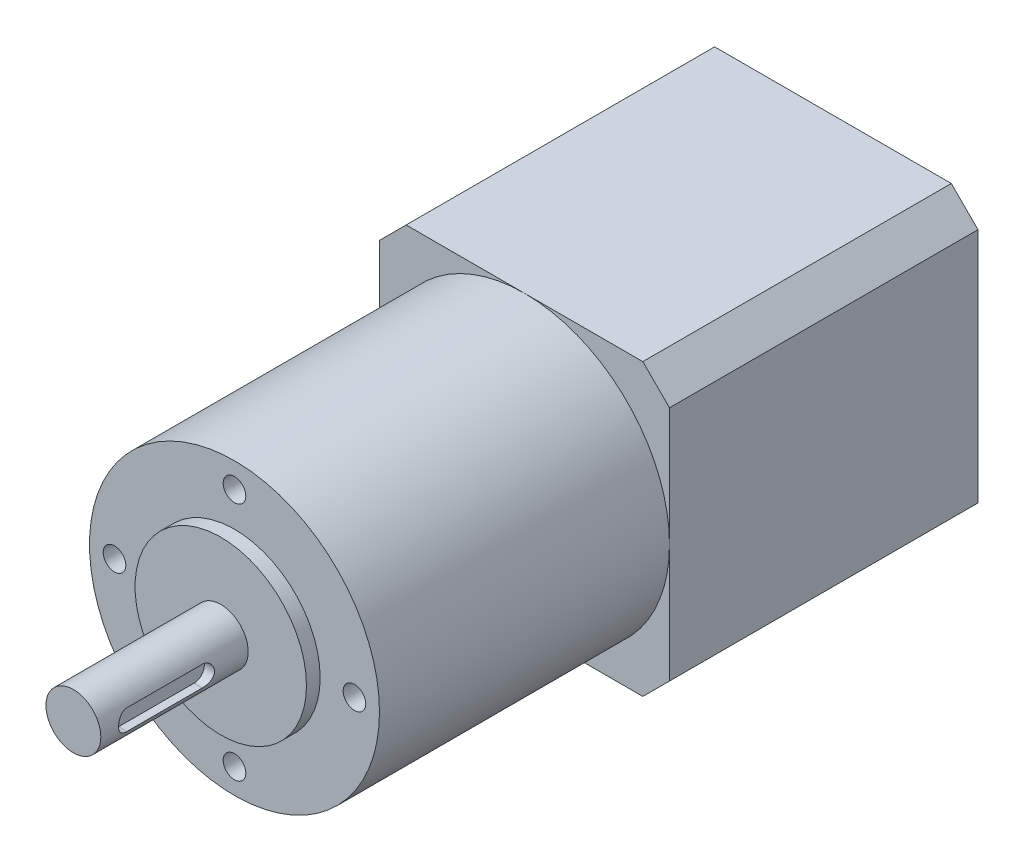
ISO-10303-21;
HEADER;
FILE_DESCRIPTION(('STEP AP214'),'2;1');
FILE_NAME('part.step','',(''),(''),'','','');
FILE_SCHEMA(('AUTOMOTIVE_DESIGN { 1 0 10303 214 1 1 1 1 }'));
ENDSEC;
DATA;
#1=APPLICATION_CONTEXT('core data for automotive mechanical design processes');
#2=APPLICATION_PROTOCOL_DEFINITION('international standard','automotive_design',2000,#1);
#3=PRODUCT_CONTEXT('',#1,'mechanical');
#4=PRODUCT('Part','Part','',(#3));
#5=PRODUCT_RELATED_PRODUCT_CATEGORY('part','',(#4));
#6=PRODUCT_DEFINITION_FORMATION('','',#4);
#7=PRODUCT_DEFINITION_CONTEXT('part definition',#1,'design');
#8=PRODUCT_DEFINITION('design','',#6,#7);
#9=PRODUCT_DEFINITION_SHAPE('','',#8);
#10=(LENGTH_UNIT() NAMED_UNIT(*) SI_UNIT(.MILLI.,.METRE.));
#11=(NAMED_UNIT(*) PLANE_ANGLE_UNIT() SI_UNIT($,.RADIAN.));
#12=(NAMED_UNIT(*) SI_UNIT($,.STERADIAN.) SOLID_ANGLE_UNIT());
#13=UNCERTAINTY_MEASURE_WITH_UNIT(LENGTH_MEASURE(1.E-05),#10,'distance_accuracy_value','');
#14=(GEOMETRIC_REPRESENTATION_CONTEXT(3) GLOBAL_UNCERTAINTY_ASSIGNED_CONTEXT((#13)) GLOBAL_UNIT_ASSIGNED_CONTEXT((#10,
#11,#12)) REPRESENTATION_CONTEXT('',''));
#15=CARTESIAN_POINT('',(0.,0.,0.));
#16=DIRECTION('',(0.,0.,1.));
#17=DIRECTION('',(1.,0.,0.));
#18=AXIS2_PLACEMENT_3D('',#15,#16,#17);
#19=CARTESIAN_POINT('',(0.,0.,45.));
#20=DIRECTION('',(0.,0.,-1.));
#21=DIRECTION('',(-1.,0.,0.));
#22=AXIS2_PLACEMENT_3D('',#19,#20,#21);
#23=PLANE('',#22);
#24=CARTESIAN_POINT('',(0.,0.,45.));
#25=DIRECTION('',(0.,0.,1.));
#26=DIRECTION('',(1.,0.,0.));
#27=AXIS2_PLACEMENT_3D('',#24,#25,#26);
#28=CIRCLE('',#27,21.15);
#29=CARTESIAN_POINT('',(21.15,0.,45.));
#30=VERTEX_POINT('',#29);
#31=CARTESIAN_POINT('',(0.,21.15,45.));
#32=VERTEX_POINT('',#31);
#33=EDGE_CURVE('E239',#30,#32,#28,.T.);
#34=ORIENTED_EDGE('',*,*,#33,.F.);
#35=DIRECTION('',(0.,1.,0.));
#36=VECTOR('',#35,1.);
#37=CARTESIAN_POINT('',(21.15,-17.260912703474,45.));
#38=LINE('',#37,#36);
#39=CARTESIAN_POINT('',(21.15,17.260912703474,45.));
#40=VERTEX_POINT('',#39);
#41=EDGE_CURVE('E260',#30,#40,#38,.T.);
#42=ORIENTED_EDGE('',*,*,#41,.T.);
#43=DIRECTION('',(-0.707106781186548,0.707106781186547,0.));
#44=VECTOR('',#43,1.);
#45=CARTESIAN_POINT('',(17.260912703474,21.15,45.));
#46=LINE('',#45,#44);
#47=CARTESIAN_POINT('',(17.260912703474,21.15,45.));
#48=VERTEX_POINT('',#47);
#49=EDGE_CURVE('E264',#40,#48,#46,.T.);
#50=ORIENTED_EDGE('',*,*,#49,.T.);
#51=DIRECTION('',(-1.,0.,0.));
#52=VECTOR('',#51,1.);
#53=CARTESIAN_POINT('',(-17.260912703474,21.15,45.));
#54=LINE('',#53,#52);
#55=EDGE_CURVE('E268',#48,#32,#54,.T.);
#56=ORIENTED_EDGE('',*,*,#55,.T.);
#57=EDGE_LOOP('',(#34,#42,#50,#56));
#58=FACE_BOUND('',#57,.T.);
#59=ADVANCED_FACE('F45',(#58),#23,.F.);
#60=CARTESIAN_POINT('',(-21.15,0.,45.));
#61=VERTEX_POINT('',#60);
#62=EDGE_CURVE('E69',#32,#61,#28,.T.);
#63=ORIENTED_EDGE('',*,*,#62,.F.);
#64=CARTESIAN_POINT('',(-17.260912703474,21.15,45.));
#65=VERTEX_POINT('',#64);
#66=EDGE_CURVE('E267',#32,#65,#54,.T.);
#67=ORIENTED_EDGE('',*,*,#66,.T.);
#68=DIRECTION('',(-0.707106781186549,-0.707106781186546,0.));
#69=VECTOR('',#68,1.);
#70=CARTESIAN_POINT('',(-21.15,17.260912703474,45.));
#71=LINE('',#70,#69);
#72=CARTESIAN_POINT('',(-21.15,17.260912703474,45.));
#73=VERTEX_POINT('',#72);
#74=EDGE_CURVE('E272',#65,#73,#71,.T.);
#75=ORIENTED_EDGE('',*,*,#74,.T.);
#76=DIRECTION('',(0.,-1.,0.));
#77=VECTOR('',#76,1.);
#78=CARTESIAN_POINT('',(-21.15,-17.260912703474,45.));
#79=LINE('',#78,#77);
#80=EDGE_CURVE('E245',#73,#61,#79,.T.);
#81=ORIENTED_EDGE('',*,*,#80,.T.);
#82=EDGE_LOOP('',(#63,#67,#75,#81));
#83=FACE_BOUND('',#82,.T.);
#84=ADVANCED_FACE('F404',(#83),#23,.F.);
#85=CARTESIAN_POINT('',(0.,-21.15,45.));
#86=VERTEX_POINT('',#85);
#87=EDGE_CURVE('E438',#61,#86,#28,.T.);
#88=ORIENTED_EDGE('',*,*,#87,.F.);
#89=CARTESIAN_POINT('',(-21.15,-17.260912703474,45.));
#90=VERTEX_POINT('',#89);
#91=EDGE_CURVE('E249',#61,#90,#79,.T.);
#92=ORIENTED_EDGE('',*,*,#91,.T.);
#93=DIRECTION('',(0.707106781186548,-0.707106781186547,0.));
#94=VECTOR('',#93,1.);
#95=CARTESIAN_POINT('',(-21.15,-17.260912703474,45.));
#96=LINE('',#95,#94);
#97=CARTESIAN_POINT('',(-17.260912703474,-21.15,45.));
#98=VERTEX_POINT('',#97);
#99=EDGE_CURVE('E248',#90,#98,#96,.T.);
#100=ORIENTED_EDGE('',*,*,#99,.T.);
#101=DIRECTION('',(1.,0.,0.));
#102=VECTOR('',#101,1.);
#103=CARTESIAN_POINT('',(-17.260912703474,-21.15,45.));
#104=LINE('',#103,#102);
#105=EDGE_CURVE('E253',#98,#86,#104,.T.);
#106=ORIENTED_EDGE('',*,*,#105,.T.);
#107=EDGE_LOOP('',(#88,#92,#100,#106));
#108=FACE_BOUND('',#107,.T.);
#109=ADVANCED_FACE('F412',(#108),#23,.F.);
#110=CARTESIAN_POINT('',(-21.15,-17.260912703474,45.));
#111=DIRECTION('',(1.,0.,0.));
#112=DIRECTION('',(0.,0.,-1.));
#113=AXIS2_PLACEMENT_3D('',#110,#111,#112);
#114=PLANE('',#113);
#115=DIRECTION('',(0.,-1.,0.));
#116=VECTOR('',#115,1.);
#117=CARTESIAN_POINT('',(-21.15,-17.260912703474,0.));
#118=LINE('',#117,#116);
#119=CARTESIAN_POINT('',(-21.15,17.260912703474,0.));
#120=VERTEX_POINT('',#119);
#121=CARTESIAN_POINT('',(-21.15,-17.260912703474,0.));
#122=VERTEX_POINT('',#121);
#123=EDGE_CURVE('E243',#120,#122,#118,.T.);
#124=ORIENTED_EDGE('',*,*,#123,.T.);
#125=DIRECTION('',(0.,0.,-1.));
#126=VECTOR('',#125,1.);
#127=CARTESIAN_POINT('',(-21.15,-17.260912703474,45.));
#128=LINE('',#127,#126);
#129=EDGE_CURVE('E327',#90,#122,#128,.T.);
#130=ORIENTED_EDGE('',*,*,#129,.F.);
#131=ORIENTED_EDGE('',*,*,#91,.F.);
#132=ORIENTED_EDGE('',*,*,#80,.F.);
#133=DIRECTION('',(0.,0.,-1.));
#134=VECTOR('',#133,1.);
#135=CARTESIAN_POINT('',(-21.15,17.260912703474,45.));
#136=LINE('',#135,#134);
#137=EDGE_CURVE('E275',#73,#120,#136,.T.);
#138=ORIENTED_EDGE('',*,*,#137,.T.);
#139=EDGE_LOOP('',(#124,#130,#131,#132,#138));
#140=FACE_BOUND('',#139,.T.);
#141=ADVANCED_FACE('F47',(#140),#114,.F.);
#142=CARTESIAN_POINT('',(-21.15,-17.260912703474,45.));
#143=DIRECTION('',(0.707106781186547,0.707106781186548,0.));
#144=DIRECTION('',(-0.707106781186548,0.707106781186547,0.));
#145=AXIS2_PLACEMENT_3D('',#142,#143,#144);
#146=PLANE('',#145);
#147=DIRECTION('',(0.707106781186548,-0.707106781186547,0.));
#148=VECTOR('',#147,1.);
#149=CARTESIAN_POINT('',(-21.15,-17.260912703474,0.));
#150=LINE('',#149,#148);
#151=CARTESIAN_POINT('',(-17.260912703474,-21.15,0.));
#152=VERTEX_POINT('',#151);
#153=EDGE_CURVE('E279',#122,#152,#150,.T.);
#154=ORIENTED_EDGE('',*,*,#153,.T.);
#155=DIRECTION('',(0.,0.,-1.));
#156=VECTOR('',#155,1.);
#157=CARTESIAN_POINT('',(-17.260912703474,-21.15,45.));
#158=LINE('',#157,#156);
#159=EDGE_CURVE('E323',#98,#152,#158,.T.);
#160=ORIENTED_EDGE('',*,*,#159,.F.);
#161=ORIENTED_EDGE('',*,*,#99,.F.);
#162=ORIENTED_EDGE('',*,*,#129,.T.);
#163=EDGE_LOOP('',(#154,#160,#161,#162));
#164=FACE_BOUND('',#163,.T.);
#165=ADVANCED_FACE('F435',(#164),#146,.F.);
#166=CARTESIAN_POINT('',(-17.260912703474,-21.15,45.));
#167=DIRECTION('',(0.,1.,0.));
#168=DIRECTION('',(0.,0.,1.));
#169=AXIS2_PLACEMENT_3D('',#166,#167,#168);
#170=PLANE('',#169);
#171=DIRECTION('',(1.,0.,0.));
#172=VECTOR('',#171,1.);
#173=CARTESIAN_POINT('',(-17.260912703474,-21.15,0.));
#174=LINE('',#173,#172);
#175=CARTESIAN_POINT('',(17.260912703474,-21.15,0.));
#176=VERTEX_POINT('',#175);
#177=EDGE_CURVE('E282',#152,#176,#174,.T.);
#178=ORIENTED_EDGE('',*,*,#177,.T.);
#179=DIRECTION('',(0.,0.,-1.));
#180=VECTOR('',#179,1.);
#181=CARTESIAN_POINT('',(17.260912703474,-21.15,45.));
#182=LINE('',#181,#180);
#183=CARTESIAN_POINT('',(17.260912703474,-21.15,45.));
#184=VERTEX_POINT('',#183);
#185=EDGE_CURVE('E319',#184,#176,#182,.T.);
#186=ORIENTED_EDGE('',*,*,#185,.F.);
#187=EDGE_CURVE('E252',#86,#184,#104,.T.);
#188=ORIENTED_EDGE('',*,*,#187,.F.);
#189=ORIENTED_EDGE('',*,*,#105,.F.);
#190=ORIENTED_EDGE('',*,*,#159,.T.);
#191=EDGE_LOOP('',(#178,#186,#188,#189,#190));
#192=FACE_BOUND('',#191,.T.);
#193=ADVANCED_FACE('F461',(#192),#170,.F.);
#194=CARTESIAN_POINT('',(17.260912703474,-21.15,45.));
#195=DIRECTION('',(-0.707106781186547,0.707106781186548,0.));
#196=DIRECTION('',(-0.707106781186548,-0.707106781186547,0.));
#197=AXIS2_PLACEMENT_3D('',#194,#195,#196);
#198=PLANE('',#197);
#199=DIRECTION('',(0.707106781186548,0.707106781186547,0.));
#200=VECTOR('',#199,1.);
#201=CARTESIAN_POINT('',(17.260912703474,-21.15,0.));
#202=LINE('',#201,#200);
#203=CARTESIAN_POINT('',(21.15,-17.260912703474,0.));
#204=VERTEX_POINT('',#203);
#205=EDGE_CURVE('E285',#176,#204,#202,.T.);
#206=ORIENTED_EDGE('',*,*,#205,.T.);
#207=DIRECTION('',(0.,0.,-1.));
#208=VECTOR('',#207,1.);
#209=CARTESIAN_POINT('',(21.15,-17.260912703474,45.));
#210=LINE('',#209,#208);
#211=CARTESIAN_POINT('',(21.15,-17.260912703474,45.));
#212=VERTEX_POINT('',#211);
#213=EDGE_CURVE('E315',#212,#204,#210,.T.);
#214=ORIENTED_EDGE('',*,*,#213,.F.);
#215=DIRECTION('',(0.707106781186548,0.707106781186547,0.));
#216=VECTOR('',#215,1.);
#217=CARTESIAN_POINT('',(17.260912703474,-21.15,45.));
#218=LINE('',#217,#216);
#219=EDGE_CURVE('E257',#184,#212,#218,.T.);
#220=ORIENTED_EDGE('',*,*,#219,.F.);
#221=ORIENTED_EDGE('',*,*,#185,.T.);
#222=EDGE_LOOP('',(#206,#214,#220,#221));
#223=FACE_BOUND('',#222,.T.);
#224=ADVANCED_FACE('F465',(#223),#198,.F.);
#225=CARTESIAN_POINT('',(21.15,-17.260912703474,45.));
#226=DIRECTION('',(-1.,0.,0.));
#227=DIRECTION('',(0.,0.,1.));
#228=AXIS2_PLACEMENT_3D('',#225,#226,#227);
#229=PLANE('',#228);
#230=DIRECTION('',(0.,1.,0.));
#231=VECTOR('',#230,1.);
#232=CARTESIAN_POINT('',(21.15,-17.260912703474,0.));
#233=LINE('',#232,#231);
#234=CARTESIAN_POINT('',(21.15,17.260912703474,0.));
#235=VERTEX_POINT('',#234);
#236=EDGE_CURVE('E288',#204,#235,#233,.T.);
#237=ORIENTED_EDGE('',*,*,#236,.T.);
#238=DIRECTION('',(0.,0.,-1.));
#239=VECTOR('',#238,1.);
#240=CARTESIAN_POINT('',(21.15,17.260912703474,45.));
#241=LINE('',#240,#239);
#242=EDGE_CURVE('E311',#40,#235,#241,.T.);
#243=ORIENTED_EDGE('',*,*,#242,.F.);
#244=ORIENTED_EDGE('',*,*,#41,.F.);
#245=EDGE_CURVE('E261',#212,#30,#38,.T.);
#246=ORIENTED_EDGE('',*,*,#245,.F.);
#247=ORIENTED_EDGE('',*,*,#213,.T.);
#248=EDGE_LOOP('',(#237,#243,#244,#246,#247));
#249=FACE_BOUND('',#248,.T.);
#250=ADVANCED_FACE('F470',(#249),#229,.F.);
#251=CARTESIAN_POINT('',(17.260912703474,21.15,45.));
#252=DIRECTION('',(-0.707106781186547,-0.707106781186548,0.));
#253=DIRECTION('',(0.707106781186548,-0.707106781186547,0.));
#254=AXIS2_PLACEMENT_3D('',#251,#252,#253);
#255=PLANE('',#254);
#256=DIRECTION('',(-0.707106781186548,0.707106781186547,0.));
#257=VECTOR('',#256,1.);
#258=CARTESIAN_POINT('',(17.260912703474,21.15,0.));
#259=LINE('',#258,#257);
#260=CARTESIAN_POINT('',(17.260912703474,21.15,0.));
#261=VERTEX_POINT('',#260);
#262=EDGE_CURVE('E291',#235,#261,#259,.T.);
#263=ORIENTED_EDGE('',*,*,#262,.T.);
#264=DIRECTION('',(0.,0.,-1.));
#265=VECTOR('',#264,1.);
#266=CARTESIAN_POINT('',(17.260912703474,21.15,45.));
#267=LINE('',#266,#265);
#268=EDGE_CURVE('E307',#48,#261,#267,.T.);
#269=ORIENTED_EDGE('',*,*,#268,.F.);
#270=ORIENTED_EDGE('',*,*,#49,.F.);
#271=ORIENTED_EDGE('',*,*,#242,.T.);
#272=EDGE_LOOP('',(#263,#269,#270,#271));
#273=FACE_BOUND('',#272,.T.);
#274=ADVANCED_FACE('F492',(#273),#255,.F.);
#275=CARTESIAN_POINT('',(-17.260912703474,21.15,45.));
#276=DIRECTION('',(0.,-1.,0.));
#277=DIRECTION('',(0.,0.,-1.));
#278=AXIS2_PLACEMENT_3D('',#275,#276,#277);
#279=PLANE('',#278);
#280=DIRECTION('',(-1.,0.,0.));
#281=VECTOR('',#280,1.);
#282=CARTESIAN_POINT('',(-17.260912703474,21.15,0.));
#283=LINE('',#282,#281);
#284=CARTESIAN_POINT('',(-17.260912703474,21.15,0.));
#285=VERTEX_POINT('',#284);
#286=EDGE_CURVE('E294',#261,#285,#283,.T.);
#287=ORIENTED_EDGE('',*,*,#286,.T.);
#288=DIRECTION('',(0.,0.,-1.));
#289=VECTOR('',#288,1.);
#290=CARTESIAN_POINT('',(-17.260912703474,21.15,45.));
#291=LINE('',#290,#289);
#292=EDGE_CURVE('E303',#65,#285,#291,.T.);
#293=ORIENTED_EDGE('',*,*,#292,.F.);
#294=ORIENTED_EDGE('',*,*,#66,.F.);
#295=ORIENTED_EDGE('',*,*,#55,.F.);
#296=ORIENTED_EDGE('',*,*,#268,.T.);
#297=EDGE_LOOP('',(#287,#293,#294,#295,#296));
#298=FACE_BOUND('',#297,.T.);
#299=ADVANCED_FACE('F427',(#298),#279,.F.);
#300=CARTESIAN_POINT('',(-21.15,17.260912703474,45.));
#301=DIRECTION('',(0.707106781186546,-0.707106781186549,0.));
#302=DIRECTION('',(0.707106781186549,0.707106781186546,0.));
#303=AXIS2_PLACEMENT_3D('',#300,#301,#302);
#304=PLANE('',#303);
#305=DIRECTION('',(-0.707106781186549,-0.707106781186546,0.));
#306=VECTOR('',#305,1.);
#307=CARTESIAN_POINT('',(-21.15,17.260912703474,0.));
#308=LINE('',#307,#306);
#309=EDGE_CURVE('E297',#285,#120,#308,.T.);
#310=ORIENTED_EDGE('',*,*,#309,.T.);
#311=ORIENTED_EDGE('',*,*,#137,.F.);
#312=ORIENTED_EDGE('',*,*,#74,.F.);
#313=ORIENTED_EDGE('',*,*,#292,.T.);
#314=EDGE_LOOP('',(#310,#311,#312,#313));
#315=FACE_BOUND('',#314,.T.);
#316=ADVANCED_FACE('F418',(#315),#304,.F.);
#317=EDGE_CURVE('E244',#86,#30,#28,.T.);
#318=ORIENTED_EDGE('',*,*,#317,.F.);
#319=ORIENTED_EDGE('',*,*,#187,.T.);
#320=ORIENTED_EDGE('',*,*,#219,.T.);
#321=ORIENTED_EDGE('',*,*,#245,.T.);
#322=EDGE_LOOP('',(#318,#319,#320,#321));
#323=FACE_BOUND('',#322,.T.);
#324=ADVANCED_FACE('F407',(#323),#23,.F.);
#325=CARTESIAN_POINT('',(0.,0.,0.));
#326=DIRECTION('',(0.,0.,-1.));
#327=DIRECTION('',(-1.,0.,0.));
#328=AXIS2_PLACEMENT_3D('',#325,#326,#327);
#329=PLANE('',#328);
#330=ORIENTED_EDGE('',*,*,#123,.F.);
#331=ORIENTED_EDGE('',*,*,#309,.F.);
#332=ORIENTED_EDGE('',*,*,#286,.F.);
#333=ORIENTED_EDGE('',*,*,#262,.F.);
#334=ORIENTED_EDGE('',*,*,#236,.F.);
#335=ORIENTED_EDGE('',*,*,#205,.F.);
#336=ORIENTED_EDGE('',*,*,#177,.F.);
#337=ORIENTED_EDGE('',*,*,#153,.F.);
#338=EDGE_LOOP('',(#330,#331,#332,#333,#334,#335,#336,#337));
#339=FACE_BOUND('',#338,.T.);
#340=ADVANCED_FACE('F417',(#339),#329,.T.);
#341=CARTESIAN_POINT('',(0.,0.,110.8));
#342=DIRECTION('',(0.,0.,1.));
#343=DIRECTION('',(1.,0.,0.));
#344=AXIS2_PLACEMENT_3D('',#341,#342,#343);
#345=CYLINDRICAL_SURFACE('',#344,21.15);
#346=CARTESIAN_POINT('',(0.,0.,87.3));
#347=DIRECTION('',(0.,0.,1.));
#348=DIRECTION('',(1.,0.,0.));
#349=AXIS2_PLACEMENT_3D('',#346,#347,#348);
#350=CIRCLE('',#349,21.15);
#351=CARTESIAN_POINT('',(21.15,0.,87.3));
#352=VERTEX_POINT('',#351);
#353=EDGE_CURVE('E235',#352,#352,#350,.T.);
#354=ORIENTED_EDGE('',*,*,#353,.F.);
#355=EDGE_LOOP('',(#354));
#356=FACE_BOUND('',#355,.T.);
#357=ORIENTED_EDGE('',*,*,#33,.T.);
#358=ORIENTED_EDGE('',*,*,#62,.T.);
#359=ORIENTED_EDGE('',*,*,#87,.T.);
#360=ORIENTED_EDGE('',*,*,#317,.T.);
#361=EDGE_LOOP('',(#357,#358,#359,#360));
#362=FACE_BOUND('',#361,.T.);
#363=ADVANCED_FACE('F424',(#356,#362),#345,.T.);
#364=CARTESIAN_POINT('',(0.,21.15,87.3));
#365=DIRECTION('',(0.,0.,-1.));
#366=DIRECTION('',(-1.,0.,0.));
#367=AXIS2_PLACEMENT_3D('',#364,#365,#366);
#368=PLANE('',#367);
#369=CARTESIAN_POINT('',(0.,17.5,87.3));
#370=DIRECTION('',(0.,0.,1.));
#371=DIRECTION('',(1.,0.,0.));
#372=AXIS2_PLACEMENT_3D('',#369,#370,#371);
#373=CIRCLE('',#372,1.65);
#374=CARTESIAN_POINT('',(1.65,17.5,87.3));
#375=VERTEX_POINT('',#374);
#376=EDGE_CURVE('E193',#375,#375,#373,.T.);
#377=ORIENTED_EDGE('',*,*,#376,.F.);
#378=EDGE_LOOP('',(#377));
#379=FACE_BOUND('',#378,.T.);
#380=CARTESIAN_POINT('',(17.5,0.,87.3));
#381=DIRECTION('',(0.,0.,1.));
#382=DIRECTION('',(1.,0.,0.));
#383=AXIS2_PLACEMENT_3D('',#380,#381,#382);
#384=CIRCLE('',#383,1.65);
#385=CARTESIAN_POINT('',(19.15,0.,87.3));
#386=VERTEX_POINT('',#385);
#387=EDGE_CURVE('E197',#386,#386,#384,.T.);
#388=ORIENTED_EDGE('',*,*,#387,.F.);
#389=EDGE_LOOP('',(#388));
#390=FACE_BOUND('',#389,.T.);
#391=CARTESIAN_POINT('',(0.,-17.5,87.3));
#392=DIRECTION('',(0.,0.,1.));
#393=DIRECTION('',(1.,0.,0.));
#394=AXIS2_PLACEMENT_3D('',#391,#392,#393);
#395=CIRCLE('',#394,1.65);
#396=CARTESIAN_POINT('',(1.65,-17.5,87.3));
#397=VERTEX_POINT('',#396);
#398=EDGE_CURVE('E205',#397,#397,#395,.T.);
#399=ORIENTED_EDGE('',*,*,#398,.F.);
#400=EDGE_LOOP('',(#399));
#401=FACE_BOUND('',#400,.T.);
#402=CARTESIAN_POINT('',(-17.5,0.,87.3));
#403=DIRECTION('',(0.,0.,1.));
#404=DIRECTION('',(1.,0.,0.));
#405=AXIS2_PLACEMENT_3D('',#402,#403,#404);
#406=CIRCLE('',#405,1.65);
#407=CARTESIAN_POINT('',(-15.85,0.,87.3));
#408=VERTEX_POINT('',#407);
#409=EDGE_CURVE('E213',#408,#408,#406,.T.);
#410=ORIENTED_EDGE('',*,*,#409,.F.);
#411=EDGE_LOOP('',(#410));
#412=FACE_BOUND('',#411,.T.);
#413=CARTESIAN_POINT('',(0.,0.,87.3));
#414=DIRECTION('',(0.,0.,1.));
#415=DIRECTION('',(1.,0.,0.));
#416=AXIS2_PLACEMENT_3D('',#413,#414,#415);
#417=CIRCLE('',#416,12.5);
#418=CARTESIAN_POINT('',(12.5,0.,87.3));
#419=VERTEX_POINT('',#418);
#420=EDGE_CURVE('E231',#419,#419,#417,.T.);
#421=ORIENTED_EDGE('',*,*,#420,.F.);
#422=EDGE_LOOP('',(#421));
#423=FACE_BOUND('',#422,.T.);
#424=ORIENTED_EDGE('',*,*,#353,.T.);
#425=EDGE_LOOP('',(#424));
#426=FACE_BOUND('',#425,.T.);
#427=ADVANCED_FACE('F565',(#379,#390,#401,#412,#423,#426),#368,.F.);
#428=CARTESIAN_POINT('',(0.,0.,110.8));
#429=DIRECTION('',(0.,0.,1.));
#430=DIRECTION('',(1.,0.,0.));
#431=AXIS2_PLACEMENT_3D('',#428,#429,#430);
#432=CYLINDRICAL_SURFACE('',#431,12.5);
#433=CARTESIAN_POINT('',(0.,0.,89.3));
#434=DIRECTION('',(0.,0.,1.));
#435=DIRECTION('',(1.,0.,0.));
#436=AXIS2_PLACEMENT_3D('',#433,#434,#435);
#437=CIRCLE('',#436,12.5);
#438=CARTESIAN_POINT('',(12.5,0.,89.3));
#439=VERTEX_POINT('',#438);
#440=EDGE_CURVE('E227',#439,#439,#437,.T.);
#441=ORIENTED_EDGE('',*,*,#440,.F.);
#442=EDGE_LOOP('',(#441));
#443=FACE_BOUND('',#442,.T.);
#444=ORIENTED_EDGE('',*,*,#420,.T.);
#445=EDGE_LOOP('',(#444));
#446=FACE_BOUND('',#445,.T.);
#447=ADVANCED_FACE('F572',(#443,#446),#432,.T.);
#448=CARTESIAN_POINT('',(0.,12.5,89.3));
#449=DIRECTION('',(0.,0.,-1.));
#450=DIRECTION('',(-1.,0.,0.));
#451=AXIS2_PLACEMENT_3D('',#448,#449,#450);
#452=PLANE('',#451);
#453=CARTESIAN_POINT('',(0.,0.,89.3));
#454=DIRECTION('',(0.,0.,1.));
#455=DIRECTION('',(1.,0.,0.));
#456=AXIS2_PLACEMENT_3D('',#453,#454,#455);
#457=CIRCLE('',#456,4.);
#458=CARTESIAN_POINT('',(4.,0.,89.3));
#459=VERTEX_POINT('',#458);
#460=EDGE_CURVE('E223',#459,#459,#457,.T.);
#461=ORIENTED_EDGE('',*,*,#460,.F.);
#462=EDGE_LOOP('',(#461));
#463=FACE_BOUND('',#462,.T.);
#464=ORIENTED_EDGE('',*,*,#440,.T.);
#465=EDGE_LOOP('',(#464));
#466=FACE_BOUND('',#465,.T.);
#467=ADVANCED_FACE('F401',(#463,#466),#452,.F.);
#468=CARTESIAN_POINT('',(0.,0.,110.8));
#469=DIRECTION('',(0.,0.,1.));
#470=DIRECTION('',(1.,0.,0.));
#471=AXIS2_PLACEMENT_3D('',#468,#469,#470);
#472=CYLINDRICAL_SURFACE('',#471,4.);
#473=DIRECTION('',(0.,0.,1.));
#474=VECTOR('',#473,1.);
#475=CARTESIAN_POINT('',(3.70809924354783,1.5,110.8));
#476=LINE('',#475,#474);
#477=CARTESIAN_POINT('',(3.70809924354783,1.5,106.7));
#478=VERTEX_POINT('',#477);
#479=CARTESIAN_POINT('',(3.70809924354783,1.5,95.7));
#480=VERTEX_POINT('',#479);
#481=EDGE_CURVE('E11',#478,#480,#476,.F.);
#482=ORIENTED_EDGE('',*,*,#481,.T.);
#483=CARTESIAN_POINT('',(3.70809924354783,1.5,95.7));
#484=CARTESIAN_POINT('',(3.70809443619347,1.50000149729856,95.6594074669704));
#485=CARTESIAN_POINT('',(3.70876663375751,1.49835118206537,95.6188360707122));
#486=CARTESIAN_POINT('',(3.71141673218275,1.49177905295192,95.5380154612726));
#487=CARTESIAN_POINT('',(3.7133941946446,1.48685833749724,95.4977661445068));
#488=CARTESIAN_POINT('',(3.72118975606221,1.46729482367935,95.3782327842747));
#489=CARTESIAN_POINT('',(3.72887188404209,1.44784998767984,95.2998003397728));
#490=CARTESIAN_POINT('',(3.74825217997877,1.39690233043372,95.1476324814849));
#491=CARTESIAN_POINT('',(3.7599469632381,1.36540966903062,95.0738931709592));
#492=CARTESIAN_POINT('',(3.7860238820009,1.29134097725474,94.9326664799386));
#493=CARTESIAN_POINT('',(3.80040821426565,1.24875587557703,94.8651842779876));
#494=CARTESIAN_POINT('',(3.83103589828726,1.15146603872017,94.7351080800593));
#495=CARTESIAN_POINT('',(3.84733374054252,1.09630269892844,94.6728699856818));
#496=CARTESIAN_POINT('',(3.8794978206844,0.97639458497426,94.5582764069826));
#497=CARTESIAN_POINT('',(3.8953639745168,0.911647960429705,94.5059228356596));
#498=CARTESIAN_POINT('',(3.92552893891844,0.771693719740039,94.4108597857463));
#499=CARTESIAN_POINT('',(3.93975598379754,0.69620496875863,94.3685393993163));
#500=CARTESIAN_POINT('',(3.96438035322528,0.538553622304923,94.2973480889171));
#501=CARTESIAN_POINT('',(3.97477910532575,0.456393528521804,94.2684721505131));
#502=CARTESIAN_POINT('',(3.99018690464435,0.291490050670586,94.2262422811784));
#503=CARTESIAN_POINT('',(3.99540906103972,0.208924649211908,94.212272615696));
#504=CARTESIAN_POINT('',(4.00064014015321,0.0424658385808872,94.198278802068));
#505=CARTESIAN_POINT('',(4.00065066686691,-0.041427154046211,94.1982503631981));
#506=CARTESIAN_POINT('',(3.99559264174045,-0.203744100069408,94.2117818062289));
#507=CARTESIAN_POINT('',(3.99077535168083,-0.282233282883083,94.2246694752074));
#508=CARTESIAN_POINT('',(3.97693262269583,-0.435840275995114,94.2625362711122));
#509=CARTESIAN_POINT('',(3.96790694481372,-0.510957894586928,94.2875160846463));
#510=CARTESIAN_POINT('',(3.94637770601049,-0.656988917196577,94.3491703925957));
#511=CARTESIAN_POINT('',(3.93382542785069,-0.727825198012183,94.3860098409234));
#512=CARTESIAN_POINT('',(3.90651314175191,-0.862486444375069,94.4701920375731));
#513=CARTESIAN_POINT('',(3.89175241632298,-0.926309119580089,94.5175382017873));
#514=CARTESIAN_POINT('',(3.86052643048222,-1.04908600084313,94.6246231314911));
#515=CARTESIAN_POINT('',(3.84401196825707,-1.10753779261244,94.684924384335));
#516=CARTESIAN_POINT('',(3.81182684214318,-1.21369725159035,94.8145841343778));
#517=CARTESIAN_POINT('',(3.79615651174147,-1.26140069584828,94.8839461746474));
#518=CARTESIAN_POINT('',(3.7671186794103,-1.34567998313248,95.0317580284138));
#519=CARTESIAN_POINT('',(3.75381153298453,-1.38197861969245,95.1103784056676));
#520=CARTESIAN_POINT('',(3.73171449181344,-1.44059114536973,95.2732063218419));
#521=CARTESIAN_POINT('',(3.72291700934123,-1.46292853893353,95.3574042049329));
#522=CARTESIAN_POINT('',(3.7140622685257,-1.48519272209728,95.4853810176477));
#523=CARTESIAN_POINT('',(3.71183476402566,-1.49074028414002,95.5281023295205));
#524=CARTESIAN_POINT('',(3.70885093143241,-1.49814308997677,95.6138740688717));
#525=CARTESIAN_POINT('',(3.70809323601798,-1.50000176547338,95.6569241530294));
#526=CARTESIAN_POINT('',(3.70809924354783,-1.5,95.7));
#527=B_SPLINE_CURVE_WITH_KNOTS('',3,(#483,#484,#485,#486,#487,#488,#489,#490,#491,#492,#493,
#494,#495,#496,#497,#498,#499,#500,#501,#502,#503,#504,#505,#506,#507,#508,#509,#510,#511,#512,
#513,#514,#515,#516,#517,#518,#519,#520,#521,#522,#523,#524,#525,#526),.UNSPECIFIED.,.F.,.F.,(4,
2,2,2,2,2,2,2,2,2,2,2,2,2,2,2,2,2,2,2,2,4),(0.,0.121697465666171,0.243354077586409,
0.485593064591345,0.727628221922012,0.969861938431276,1.22298027419405,1.47614754705133,
1.73793539440997,1.9996255232324,2.25002925199202,2.5003559133568,2.73829765644058,
2.97625291175452,3.21767225141682,3.45917019544674,3.7147799395163,3.97048993642582,
4.23200510445915,4.49307880432489,4.62233004062784,4.75146098044212),.UNSPECIFIED.);
#528=CARTESIAN_POINT('',(3.70809924354783,-1.5,95.7));
#529=VERTEX_POINT('',#528);
#530=EDGE_CURVE('E331',#480,#529,#527,.T.);
#531=ORIENTED_EDGE('',*,*,#530,.T.);
#532=DIRECTION('',(0.,0.,1.));
#533=VECTOR('',#532,1.);
#534=CARTESIAN_POINT('',(3.70809924354783,-1.5,110.8));
#535=LINE('',#534,#533);
#536=CARTESIAN_POINT('',(3.70809924354783,-1.5,106.7));
#537=VERTEX_POINT('',#536);
#538=EDGE_CURVE('E54',#529,#537,#535,.T.);
#539=ORIENTED_EDGE('',*,*,#538,.T.);
#540=CARTESIAN_POINT('',(3.70809924354783,-1.5,106.7));
#541=CARTESIAN_POINT('',(3.70809443619347,-1.50000149729856,106.74059253303));
#542=CARTESIAN_POINT('',(3.70876663375751,-1.49835118206537,106.781163929288));
#543=CARTESIAN_POINT('',(3.71141673218275,-1.49177905295192,106.861984538727));
#544=CARTESIAN_POINT('',(3.7133941946446,-1.48685833749724,106.902233855493));
#545=CARTESIAN_POINT('',(3.72118975606221,-1.46729482367934,107.021767215725));
#546=CARTESIAN_POINT('',(3.72887188404209,-1.44784998767984,107.100199660227));
#547=CARTESIAN_POINT('',(3.74825217997877,-1.39690233043372,107.252367518515));
#548=CARTESIAN_POINT('',(3.7599469632381,-1.36540966903062,107.326106829041));
#549=CARTESIAN_POINT('',(3.7860238820009,-1.29134097725474,107.467333520061));
#550=CARTESIAN_POINT('',(3.80040821426565,-1.24875587557703,107.534815722012));
#551=CARTESIAN_POINT('',(3.83103589828726,-1.15146603872017,107.664891919941));
#552=CARTESIAN_POINT('',(3.84733374054252,-1.09630269892844,107.727130014318));
#553=CARTESIAN_POINT('',(3.8794978206844,-0.976394584974256,107.841723593017));
#554=CARTESIAN_POINT('',(3.8953639745168,-0.911647960429702,107.89407716434));
#555=CARTESIAN_POINT('',(3.92552893891844,-0.77169371974004,107.989140214254));
#556=CARTESIAN_POINT('',(3.93975598379754,-0.696204968758633,108.031460600684));
#557=CARTESIAN_POINT('',(3.96438035322527,-0.538553622304927,108.102651911083));
#558=CARTESIAN_POINT('',(3.97477910532575,-0.456393528521805,108.131527849487));
#559=CARTESIAN_POINT('',(3.99018690464435,-0.291490050670586,108.173757718822));
#560=CARTESIAN_POINT('',(3.99540906103972,-0.208924649211908,108.187727384304));
#561=CARTESIAN_POINT('',(4.00064014015321,-0.0424658385808873,108.201721197932));
#562=CARTESIAN_POINT('',(4.00065066686691,0.041427154046211,108.201749636802));
#563=CARTESIAN_POINT('',(3.99559264174045,0.203744100069409,108.188218193771));
#564=CARTESIAN_POINT('',(3.99077535168083,0.282233282883085,108.175330524793));
#565=CARTESIAN_POINT('',(3.97693262269583,0.435840275995116,108.137463728888));
#566=CARTESIAN_POINT('',(3.96790694481372,0.510957894586929,108.112483915354));
#567=CARTESIAN_POINT('',(3.94637770601049,0.656988917196575,108.050829607404));
#568=CARTESIAN_POINT('',(3.93382542785069,0.727825198012178,108.013990159077));
#569=CARTESIAN_POINT('',(3.90651314175191,0.862486444375065,107.929807962427));
#570=CARTESIAN_POINT('',(3.89175241632298,0.926309119580088,107.882461798213));
#571=CARTESIAN_POINT('',(3.86052643048222,1.04908600084313,107.775376868509));
#572=CARTESIAN_POINT('',(3.84401196825707,1.10753779261244,107.715075615665));
#573=CARTESIAN_POINT('',(3.81182684214318,1.21369725159035,107.585415865622));
#574=CARTESIAN_POINT('',(3.79615651174147,1.26140069584828,107.516053825353));
#575=CARTESIAN_POINT('',(3.7671186794103,1.34567998313248,107.368241971586));
#576=CARTESIAN_POINT('',(3.75381153298453,1.38197861969245,107.289621594332));
#577=CARTESIAN_POINT('',(3.73171449181344,1.44059114536973,107.126793678158));
#578=CARTESIAN_POINT('',(3.72291700934124,1.46292853893353,107.042595795067));
#579=CARTESIAN_POINT('',(3.7140622685257,1.48519272209728,106.914618982352));
#580=CARTESIAN_POINT('',(3.71183476402566,1.49074028414002,106.871897670479));
#581=CARTESIAN_POINT('',(3.70885093143241,1.49814308997677,106.786125931128));
#582=CARTESIAN_POINT('',(3.70809323601798,1.50000176547338,106.743075846971));
#583=CARTESIAN_POINT('',(3.70809924354783,1.5,106.7));
#584=B_SPLINE_CURVE_WITH_KNOTS('',3,(#540,#541,#542,#543,#544,#545,#546,#547,#548,#549,#550,
#551,#552,#553,#554,#555,#556,#557,#558,#559,#560,#561,#562,#563,#564,#565,#566,#567,#568,#569,
#570,#571,#572,#573,#574,#575,#576,#577,#578,#579,#580,#581,#582,#583),.UNSPECIFIED.,.F.,.F.,(4,
2,2,2,2,2,2,2,2,2,2,2,2,2,2,2,2,2,2,2,2,4),(0.,0.121697465666185,0.243354077586423,
0.485593064591345,0.727628221921996,0.969861938431276,1.22298027419407,1.47614754705133,
1.73793539440997,1.9996255232324,2.25002925199203,2.50035591335681,2.73829765644058,
2.97625291175452,3.21767225141682,3.45917019544674,3.7147799395163,3.97048993642582,
4.23200510445914,4.4930788043249,4.62233004062784,4.75146098044212),.UNSPECIFIED.);
#585=EDGE_CURVE('E61',#537,#478,#584,.T.);
#586=ORIENTED_EDGE('',*,*,#585,.T.);
#587=EDGE_LOOP('',(#482,#531,#539,#586));
#588=FACE_BOUND('',#587,.T.);
#589=CARTESIAN_POINT('',(0.,0.,110.8));
#590=DIRECTION('',(0.,0.,1.));
#591=DIRECTION('',(1.,0.,0.));
#592=AXIS2_PLACEMENT_3D('',#589,#590,#591);
#593=CIRCLE('',#592,4.);
#594=CARTESIAN_POINT('',(4.,0.,110.8));
#595=VERTEX_POINT('',#594);
#596=EDGE_CURVE('E192',#595,#595,#593,.T.);
#597=ORIENTED_EDGE('',*,*,#596,.F.);
#598=EDGE_LOOP('',(#597));
#599=FACE_BOUND('',#598,.T.);
#600=ORIENTED_EDGE('',*,*,#460,.T.);
#601=EDGE_LOOP('',(#600));
#602=FACE_BOUND('',#601,.T.);
#603=ADVANCED_FACE('F346',(#588,#599,#602),#472,.T.);
#604=CARTESIAN_POINT('',(0.,4.,110.8));
#605=DIRECTION('',(0.,0.,-1.));
#606=DIRECTION('',(-1.,0.,0.));
#607=AXIS2_PLACEMENT_3D('',#604,#605,#606);
#608=PLANE('',#607);
#609=ORIENTED_EDGE('',*,*,#596,.T.);
#610=EDGE_LOOP('',(#609));
#611=FACE_BOUND('',#610,.T.);
#612=ADVANCED_FACE('F390',(#611),#608,.F.);
#613=CARTESIAN_POINT('',(-17.5,0.,80.3));
#614=DIRECTION('',(0.,0.,1.));
#615=DIRECTION('',(1.,0.,0.));
#616=AXIS2_PLACEMENT_3D('',#613,#614,#615);
#617=CYLINDRICAL_SURFACE('',#616,1.65);
#618=CARTESIAN_POINT('',(-17.5,0.,80.3));
#619=DIRECTION('',(0.,0.,1.));
#620=DIRECTION('',(1.,0.,0.));
#621=AXIS2_PLACEMENT_3D('',#618,#619,#620);
#622=CIRCLE('',#621,1.65);
#623=CARTESIAN_POINT('',(-15.85,0.,80.3));
#624=VERTEX_POINT('',#623);
#625=EDGE_CURVE('E181',#624,#624,#622,.T.);
#626=ORIENTED_EDGE('',*,*,#625,.F.);
#627=EDGE_LOOP('',(#626));
#628=FACE_BOUND('',#627,.T.);
#629=ORIENTED_EDGE('',*,*,#409,.T.);
#630=EDGE_LOOP('',(#629));
#631=FACE_BOUND('',#630,.T.);
#632=ADVANCED_FACE('F387',(#628,#631),#617,.F.);
#633=CARTESIAN_POINT('',(-17.5,0.,80.3));
#634=DIRECTION('',(0.,0.,1.));
#635=DIRECTION('',(1.,0.,0.));
#636=AXIS2_PLACEMENT_3D('',#633,#634,#635);
#637=PLANE('',#636);
#638=ORIENTED_EDGE('',*,*,#625,.T.);
#639=EDGE_LOOP('',(#638));
#640=FACE_BOUND('',#639,.T.);
#641=ADVANCED_FACE('F382',(#640),#637,.T.);
#642=CARTESIAN_POINT('',(0.,-17.5,80.3));
#643=DIRECTION('',(0.,0.,1.));
#644=DIRECTION('',(1.,0.,0.));
#645=AXIS2_PLACEMENT_3D('',#642,#643,#644);
#646=CYLINDRICAL_SURFACE('',#645,1.65);
#647=CARTESIAN_POINT('',(0.,-17.5,80.3));
#648=DIRECTION('',(0.,0.,1.));
#649=DIRECTION('',(1.,0.,0.));
#650=AXIS2_PLACEMENT_3D('',#647,#648,#649);
#651=CIRCLE('',#650,1.65);
#652=CARTESIAN_POINT('',(1.65,-17.5,80.3));
#653=VERTEX_POINT('',#652);
#654=EDGE_CURVE('E209',#653,#653,#651,.T.);
#655=ORIENTED_EDGE('',*,*,#654,.F.);
#656=EDGE_LOOP('',(#655));
#657=FACE_BOUND('',#656,.T.);
#658=ORIENTED_EDGE('',*,*,#398,.T.);
#659=EDGE_LOOP('',(#658));
#660=FACE_BOUND('',#659,.T.);
#661=ADVANCED_FACE('F379',(#657,#660),#646,.F.);
#662=CARTESIAN_POINT('',(0.,-17.5,80.3));
#663=DIRECTION('',(0.,0.,1.));
#664=DIRECTION('',(1.,0.,0.));
#665=AXIS2_PLACEMENT_3D('',#662,#663,#664);
#666=PLANE('',#665);
#667=ORIENTED_EDGE('',*,*,#654,.T.);
#668=EDGE_LOOP('',(#667));
#669=FACE_BOUND('',#668,.T.);
#670=ADVANCED_FACE('F374',(#669),#666,.T.);
#671=CARTESIAN_POINT('',(17.5,0.,80.3));
#672=DIRECTION('',(0.,0.,1.));
#673=DIRECTION('',(1.,0.,0.));
#674=AXIS2_PLACEMENT_3D('',#671,#672,#673);
#675=CYLINDRICAL_SURFACE('',#674,1.65);
#676=CARTESIAN_POINT('',(17.5,0.,80.3));
#677=DIRECTION('',(0.,0.,1.));
#678=DIRECTION('',(1.,0.,0.));
#679=AXIS2_PLACEMENT_3D('',#676,#677,#678);
#680=CIRCLE('',#679,1.65);
#681=CARTESIAN_POINT('',(19.15,0.,80.3));
#682=VERTEX_POINT('',#681);
#683=EDGE_CURVE('E201',#682,#682,#680,.T.);
#684=ORIENTED_EDGE('',*,*,#683,.F.);
#685=EDGE_LOOP('',(#684));
#686=FACE_BOUND('',#685,.T.);
#687=ORIENTED_EDGE('',*,*,#387,.T.);
#688=EDGE_LOOP('',(#687));
#689=FACE_BOUND('',#688,.T.);
#690=ADVANCED_FACE('F371',(#686,#689),#675,.F.);
#691=CARTESIAN_POINT('',(17.5,0.,80.3));
#692=DIRECTION('',(0.,0.,1.));
#693=DIRECTION('',(1.,0.,0.));
#694=AXIS2_PLACEMENT_3D('',#691,#692,#693);
#695=PLANE('',#694);
#696=ORIENTED_EDGE('',*,*,#683,.T.);
#697=EDGE_LOOP('',(#696));
#698=FACE_BOUND('',#697,.T.);
#699=ADVANCED_FACE('F369',(#698),#695,.T.);
#700=CARTESIAN_POINT('',(0.,17.5,80.3));
#701=DIRECTION('',(0.,0.,1.));
#702=DIRECTION('',(1.,0.,0.));
#703=AXIS2_PLACEMENT_3D('',#700,#701,#702);
#704=CYLINDRICAL_SURFACE('',#703,1.65);
#705=CARTESIAN_POINT('',(0.,17.5,80.3));
#706=DIRECTION('',(0.,0.,1.));
#707=DIRECTION('',(1.,0.,0.));
#708=AXIS2_PLACEMENT_3D('',#705,#706,#707);
#709=CIRCLE('',#708,1.65);
#710=CARTESIAN_POINT('',(1.65,17.5,80.3));
#711=VERTEX_POINT('',#710);
#712=EDGE_CURVE('E188',#711,#711,#709,.T.);
#713=ORIENTED_EDGE('',*,*,#712,.F.);
#714=EDGE_LOOP('',(#713));
#715=FACE_BOUND('',#714,.T.);
#716=ORIENTED_EDGE('',*,*,#376,.T.);
#717=EDGE_LOOP('',(#716));
#718=FACE_BOUND('',#717,.T.);
#719=ADVANCED_FACE('F365',(#715,#718),#704,.F.);
#720=CARTESIAN_POINT('',(0.,17.5,80.3));
#721=DIRECTION('',(0.,0.,1.));
#722=DIRECTION('',(1.,0.,0.));
#723=AXIS2_PLACEMENT_3D('',#720,#721,#722);
#724=PLANE('',#723);
#725=ORIENTED_EDGE('',*,*,#712,.T.);
#726=EDGE_LOOP('',(#725));
#727=FACE_BOUND('',#726,.T.);
#728=ADVANCED_FACE('F362',(#727),#724,.T.);
#729=CARTESIAN_POINT('',(2.5,0.,106.7));
#730=DIRECTION('',(1.,0.,0.));
#731=DIRECTION('',(0.,0.,-1.));
#732=AXIS2_PLACEMENT_3D('',#729,#730,#731);
#733=CYLINDRICAL_SURFACE('',#732,1.5);
#734=DIRECTION('',(1.,0.,0.));
#735=VECTOR('',#734,1.);
#736=CARTESIAN_POINT('',(2.5,-1.5,106.7));
#737=LINE('',#736,#735);
#738=CARTESIAN_POINT('',(2.5,-1.5,106.7));
#739=VERTEX_POINT('',#738);
#740=EDGE_CURVE('E147',#739,#537,#737,.T.);
#741=ORIENTED_EDGE('',*,*,#740,.F.);
#742=CARTESIAN_POINT('',(2.5,0.,106.7));
#743=DIRECTION('',(1.,0.,0.));
#744=DIRECTION('',(0.,0.,-1.));
#745=AXIS2_PLACEMENT_3D('',#742,#743,#744);
#746=CIRCLE('',#745,1.5);
#747=CARTESIAN_POINT('',(2.5,1.5,106.7));
#748=VERTEX_POINT('',#747);
#749=EDGE_CURVE('E151',#748,#739,#746,.T.);
#750=ORIENTED_EDGE('',*,*,#749,.F.);
#751=DIRECTION('',(1.,0.,0.));
#752=VECTOR('',#751,1.);
#753=CARTESIAN_POINT('',(2.5,1.5,106.7));
#754=LINE('',#753,#752);
#755=EDGE_CURVE('E178',#748,#478,#754,.T.);
#756=ORIENTED_EDGE('',*,*,#755,.T.);
#757=ORIENTED_EDGE('',*,*,#585,.F.);
#758=EDGE_LOOP('',(#741,#750,#756,#757));
#759=FACE_BOUND('',#758,.T.);
#760=ADVANCED_FACE('F149',(#759),#733,.F.);
#761=CARTESIAN_POINT('',(2.5,1.5,106.7));
#762=DIRECTION('',(0.,1.,0.));
#763=DIRECTION('',(0.,0.,1.));
#764=AXIS2_PLACEMENT_3D('',#761,#762,#763);
#765=PLANE('',#764);
#766=ORIENTED_EDGE('',*,*,#755,.F.);
#767=DIRECTION('',(0.,0.,1.));
#768=VECTOR('',#767,1.);
#769=CARTESIAN_POINT('',(2.5,1.5,106.7));
#770=LINE('',#769,#768);
#771=CARTESIAN_POINT('',(2.5,1.5,95.7));
#772=VERTEX_POINT('',#771);
#773=EDGE_CURVE('E157',#772,#748,#770,.T.);
#774=ORIENTED_EDGE('',*,*,#773,.F.);
#775=DIRECTION('',(1.,0.,0.));
#776=VECTOR('',#775,1.);
#777=CARTESIAN_POINT('',(2.5,1.5,95.7));
#778=LINE('',#777,#776);
#779=EDGE_CURVE('E182',#772,#480,#778,.T.);
#780=ORIENTED_EDGE('',*,*,#779,.T.);
#781=ORIENTED_EDGE('',*,*,#481,.F.);
#782=EDGE_LOOP('',(#766,#774,#780,#781));
#783=FACE_BOUND('',#782,.T.);
#784=ADVANCED_FACE('F355',(#783),#765,.F.);
#785=CARTESIAN_POINT('',(2.5,0.,95.7));
#786=DIRECTION('',(1.,0.,0.));
#787=DIRECTION('',(0.,0.,-1.));
#788=AXIS2_PLACEMENT_3D('',#785,#786,#787);
#789=CYLINDRICAL_SURFACE('',#788,1.5);
#790=ORIENTED_EDGE('',*,*,#779,.F.);
#791=CARTESIAN_POINT('',(2.5,0.,95.7));
#792=DIRECTION('',(1.,0.,0.));
#793=DIRECTION('',(0.,0.,-1.));
#794=AXIS2_PLACEMENT_3D('',#791,#792,#793);
#795=CIRCLE('',#794,1.5);
#796=CARTESIAN_POINT('',(2.5,-1.5,95.7));
#797=VERTEX_POINT('',#796);
#798=EDGE_CURVE('E167',#797,#772,#795,.T.);
#799=ORIENTED_EDGE('',*,*,#798,.F.);
#800=DIRECTION('',(1.,0.,0.));
#801=VECTOR('',#800,1.);
#802=CARTESIAN_POINT('',(2.5,-1.5,95.7));
#803=LINE('',#802,#801);
#804=EDGE_CURVE('E156',#797,#529,#803,.T.);
#805=ORIENTED_EDGE('',*,*,#804,.T.);
#806=ORIENTED_EDGE('',*,*,#530,.F.);
#807=EDGE_LOOP('',(#790,#799,#805,#806));
#808=FACE_BOUND('',#807,.T.);
#809=ADVANCED_FACE('F350',(#808),#789,.F.);
#810=CARTESIAN_POINT('',(2.5,-1.5,106.7));
#811=DIRECTION('',(0.,-1.,0.));
#812=DIRECTION('',(0.,0.,-1.));
#813=AXIS2_PLACEMENT_3D('',#810,#811,#812);
#814=PLANE('',#813);
#815=ORIENTED_EDGE('',*,*,#804,.F.);
#816=DIRECTION('',(0.,0.,-1.));
#817=VECTOR('',#816,1.);
#818=CARTESIAN_POINT('',(2.5,-1.5,106.7));
#819=LINE('',#818,#817);
#820=EDGE_CURVE('E160',#739,#797,#819,.T.);
#821=ORIENTED_EDGE('',*,*,#820,.F.);
#822=ORIENTED_EDGE('',*,*,#740,.T.);
#823=ORIENTED_EDGE('',*,*,#538,.F.);
#824=EDGE_LOOP('',(#815,#821,#822,#823));
#825=FACE_BOUND('',#824,.T.);
#826=ADVANCED_FACE('F161',(#825),#814,.F.);
#827=CARTESIAN_POINT('',(2.5,0.,106.7));
#828=DIRECTION('',(1.,0.,0.));
#829=DIRECTION('',(0.,0.,-1.));
#830=AXIS2_PLACEMENT_3D('',#827,#828,#829);
#831=PLANE('',#830);
#832=ORIENTED_EDGE('',*,*,#749,.T.);
#833=ORIENTED_EDGE('',*,*,#820,.T.);
#834=ORIENTED_EDGE('',*,*,#798,.T.);
#835=ORIENTED_EDGE('',*,*,#773,.T.);
#836=EDGE_LOOP('',(#832,#833,#834,#835));
#837=FACE_BOUND('',#836,.T.);
#838=ADVANCED_FACE('F169',(#837),#831,.T.);
#839=CLOSED_SHELL('',(#59,#84,#109,#141,#165,#193,#224,#250,#274,#299,#316,#324,#340,#363,#427,
#447,#467,#603,#612,#632,#641,#661,#670,#690,#699,#719,#728,#760,#784,#809,#826,#838));
#840=MANIFOLD_SOLID_BREP('B2',#839);
#841=ADVANCED_BREP_SHAPE_REPRESENTATION('',(#18,#840),#14);
#842=SHAPE_DEFINITION_REPRESENTATION(#9,#841);
ENDSEC;
END-ISO-10303-21;
